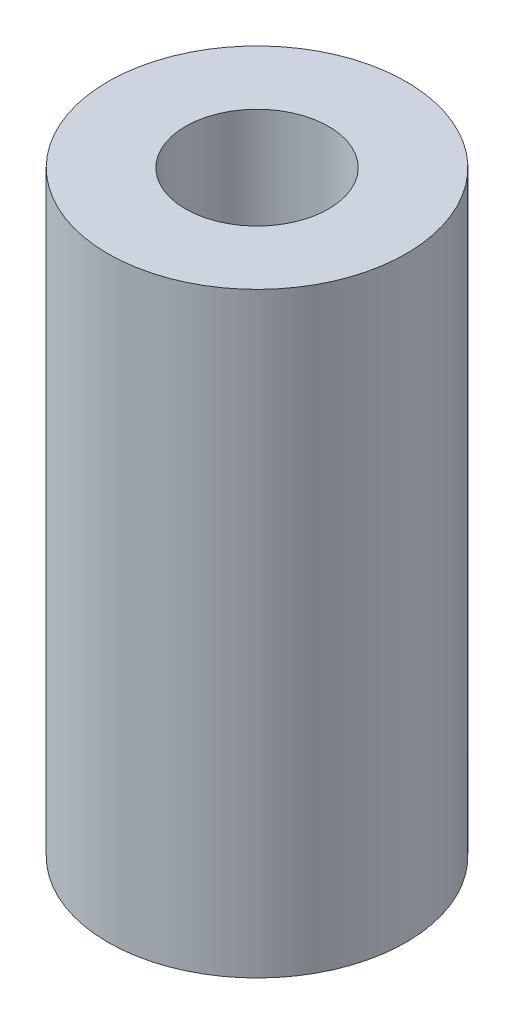
ISO-10303-21;
HEADER;
FILE_DESCRIPTION(('STEP AP214'),'2;1');
FILE_NAME('part.step','',(''),(''),'','','');
FILE_SCHEMA(('AUTOMOTIVE_DESIGN { 1 0 10303 214 1 1 1 1 }'));
ENDSEC;
DATA;
#1=APPLICATION_CONTEXT('core data for automotive mechanical design processes');
#2=APPLICATION_PROTOCOL_DEFINITION('international standard','automotive_design',2000,#1);
#3=PRODUCT_CONTEXT('',#1,'mechanical');
#4=PRODUCT('Part','Part','',(#3));
#5=PRODUCT_RELATED_PRODUCT_CATEGORY('part','',(#4));
#6=PRODUCT_DEFINITION_FORMATION('','',#4);
#7=PRODUCT_DEFINITION_CONTEXT('part definition',#1,'design');
#8=PRODUCT_DEFINITION('design','',#6,#7);
#9=PRODUCT_DEFINITION_SHAPE('','',#8);
#10=(LENGTH_UNIT() NAMED_UNIT(*) SI_UNIT(.MILLI.,.METRE.));
#11=(NAMED_UNIT(*) PLANE_ANGLE_UNIT() SI_UNIT($,.RADIAN.));
#12=(NAMED_UNIT(*) SI_UNIT($,.STERADIAN.) SOLID_ANGLE_UNIT());
#13=UNCERTAINTY_MEASURE_WITH_UNIT(LENGTH_MEASURE(1.E-05),#10,'distance_accuracy_value','');
#14=(GEOMETRIC_REPRESENTATION_CONTEXT(3) GLOBAL_UNCERTAINTY_ASSIGNED_CONTEXT((#13)) GLOBAL_UNIT_ASSIGNED_CONTEXT((#10,
#11,#12)) REPRESENTATION_CONTEXT('',''));
#15=CARTESIAN_POINT('',(0.,0.,0.));
#16=DIRECTION('',(0.,0.,1.));
#17=DIRECTION('',(1.,0.,0.));
#18=AXIS2_PLACEMENT_3D('',#15,#16,#17);
#19=CARTESIAN_POINT('',(0.,10.,0.));
#20=DIRECTION('',(0.,-1.,0.));
#21=DIRECTION('',(0.,0.,-1.));
#22=AXIS2_PLACEMENT_3D('',#19,#20,#21);
#23=CYLINDRICAL_SURFACE('',#22,2.5);
#24=CARTESIAN_POINT('',(0.,10.,0.));
#25=DIRECTION('',(0.,1.,0.));
#26=DIRECTION('',(0.,0.,1.));
#27=AXIS2_PLACEMENT_3D('',#24,#25,#26);
#28=CIRCLE('',#27,2.5);
#29=CARTESIAN_POINT('',(0.,10.,2.5));
#30=VERTEX_POINT('',#29);
#31=EDGE_CURVE('E10',#30,#30,#28,.T.);
#32=ORIENTED_EDGE('',*,*,#31,.F.);
#33=EDGE_LOOP('',(#32));
#34=FACE_BOUND('',#33,.T.);
#35=CARTESIAN_POINT('',(0.,0.,0.));
#36=DIRECTION('',(0.,1.,0.));
#37=DIRECTION('',(0.,0.,1.));
#38=AXIS2_PLACEMENT_3D('',#35,#36,#37);
#39=CIRCLE('',#38,2.5);
#40=CARTESIAN_POINT('',(0.,0.,2.5));
#41=VERTEX_POINT('',#40);
#42=EDGE_CURVE('E40',#41,#41,#39,.T.);
#43=ORIENTED_EDGE('',*,*,#42,.T.);
#44=EDGE_LOOP('',(#43));
#45=FACE_BOUND('',#44,.T.);
#46=ADVANCED_FACE('F37',(#34,#45),#23,.T.);
#47=CARTESIAN_POINT('',(0.,10.,0.));
#48=DIRECTION('',(0.,1.,0.));
#49=DIRECTION('',(0.,0.,1.));
#50=AXIS2_PLACEMENT_3D('',#47,#48,#49);
#51=PLANE('',#50);
#52=CARTESIAN_POINT('',(0.,10.,0.));
#53=DIRECTION('',(0.,1.,0.));
#54=DIRECTION('',(0.,0.,1.));
#55=AXIS2_PLACEMENT_3D('',#52,#53,#54);
#56=CIRCLE('',#55,1.2);
#57=CARTESIAN_POINT('',(0.,10.,1.2));
#58=VERTEX_POINT('',#57);
#59=EDGE_CURVE('E51',#58,#58,#56,.T.);
#60=ORIENTED_EDGE('',*,*,#59,.F.);
#61=EDGE_LOOP('',(#60));
#62=FACE_BOUND('',#61,.T.);
#63=ORIENTED_EDGE('',*,*,#31,.T.);
#64=EDGE_LOOP('',(#63));
#65=FACE_BOUND('',#64,.T.);
#66=ADVANCED_FACE('F80',(#62,#65),#51,.T.);
#67=CARTESIAN_POINT('',(0.,0.,0.));
#68=DIRECTION('',(0.,1.,0.));
#69=DIRECTION('',(0.,0.,1.));
#70=AXIS2_PLACEMENT_3D('',#67,#68,#69);
#71=PLANE('',#70);
#72=CARTESIAN_POINT('',(0.,0.,0.));
#73=DIRECTION('',(0.,-1.,0.));
#74=DIRECTION('',(0.,0.,-1.));
#75=AXIS2_PLACEMENT_3D('',#72,#73,#74);
#76=CIRCLE('',#75,1.2);
#77=CARTESIAN_POINT('',(0.,0.,-1.2));
#78=VERTEX_POINT('',#77);
#79=EDGE_CURVE('E59',#78,#78,#76,.T.);
#80=ORIENTED_EDGE('',*,*,#79,.F.);
#81=EDGE_LOOP('',(#80));
#82=FACE_BOUND('',#81,.T.);
#83=ORIENTED_EDGE('',*,*,#42,.F.);
#84=EDGE_LOOP('',(#83));
#85=FACE_BOUND('',#84,.T.);
#86=ADVANCED_FACE('F76',(#82,#85),#71,.F.);
#87=CARTESIAN_POINT('',(0.,7.,0.));
#88=DIRECTION('',(0.,1.,0.));
#89=DIRECTION('',(0.,0.,1.));
#90=AXIS2_PLACEMENT_3D('',#87,#88,#89);
#91=CYLINDRICAL_SURFACE('',#90,1.2);
#92=CARTESIAN_POINT('',(0.,7.,0.));
#93=DIRECTION('',(0.,1.,0.));
#94=DIRECTION('',(0.,0.,1.));
#95=AXIS2_PLACEMENT_3D('',#92,#93,#94);
#96=CIRCLE('',#95,1.2);
#97=CARTESIAN_POINT('',(0.,7.,1.2));
#98=VERTEX_POINT('',#97);
#99=EDGE_CURVE('E49',#98,#98,#96,.T.);
#100=ORIENTED_EDGE('',*,*,#99,.F.);
#101=EDGE_LOOP('',(#100));
#102=FACE_BOUND('',#101,.T.);
#103=ORIENTED_EDGE('',*,*,#59,.T.);
#104=EDGE_LOOP('',(#103));
#105=FACE_BOUND('',#104,.T.);
#106=ADVANCED_FACE('F79',(#102,#105),#91,.F.);
#107=CARTESIAN_POINT('',(0.,7.,0.));
#108=DIRECTION('',(0.,1.,0.));
#109=DIRECTION('',(0.,0.,1.));
#110=AXIS2_PLACEMENT_3D('',#107,#108,#109);
#111=PLANE('',#110);
#112=ORIENTED_EDGE('',*,*,#99,.T.);
#113=EDGE_LOOP('',(#112));
#114=FACE_BOUND('',#113,.T.);
#115=ADVANCED_FACE('F72',(#114),#111,.T.);
#116=CARTESIAN_POINT('',(0.,3.,0.));
#117=DIRECTION('',(0.,-1.,0.));
#118=DIRECTION('',(0.,0.,-1.));
#119=AXIS2_PLACEMENT_3D('',#116,#117,#118);
#120=CYLINDRICAL_SURFACE('',#119,1.2);
#121=CARTESIAN_POINT('',(0.,3.,0.));
#122=DIRECTION('',(0.,-1.,0.));
#123=DIRECTION('',(0.,0.,-1.));
#124=AXIS2_PLACEMENT_3D('',#121,#122,#123);
#125=CIRCLE('',#124,1.2);
#126=CARTESIAN_POINT('',(0.,3.,-1.2));
#127=VERTEX_POINT('',#126);
#128=EDGE_CURVE('E55',#127,#127,#125,.T.);
#129=ORIENTED_EDGE('',*,*,#128,.F.);
#130=EDGE_LOOP('',(#129));
#131=FACE_BOUND('',#130,.T.);
#132=ORIENTED_EDGE('',*,*,#79,.T.);
#133=EDGE_LOOP('',(#132));
#134=FACE_BOUND('',#133,.T.);
#135=ADVANCED_FACE('F69',(#131,#134),#120,.F.);
#136=CARTESIAN_POINT('',(0.,3.,0.));
#137=DIRECTION('',(0.,-1.,0.));
#138=DIRECTION('',(0.,0.,-1.));
#139=AXIS2_PLACEMENT_3D('',#136,#137,#138);
#140=PLANE('',#139);
#141=ORIENTED_EDGE('',*,*,#128,.T.);
#142=EDGE_LOOP('',(#141));
#143=FACE_BOUND('',#142,.T.);
#144=ADVANCED_FACE('F67',(#143),#140,.T.);
#145=CLOSED_SHELL('',(#46,#66,#86,#106,#115,#135,#144));
#146=MANIFOLD_SOLID_BREP('B2',#145);
#147=ADVANCED_BREP_SHAPE_REPRESENTATION('',(#18,#146),#14);
#148=SHAPE_DEFINITION_REPRESENTATION(#9,#147);
ENDSEC;
END-ISO-10303-21;
